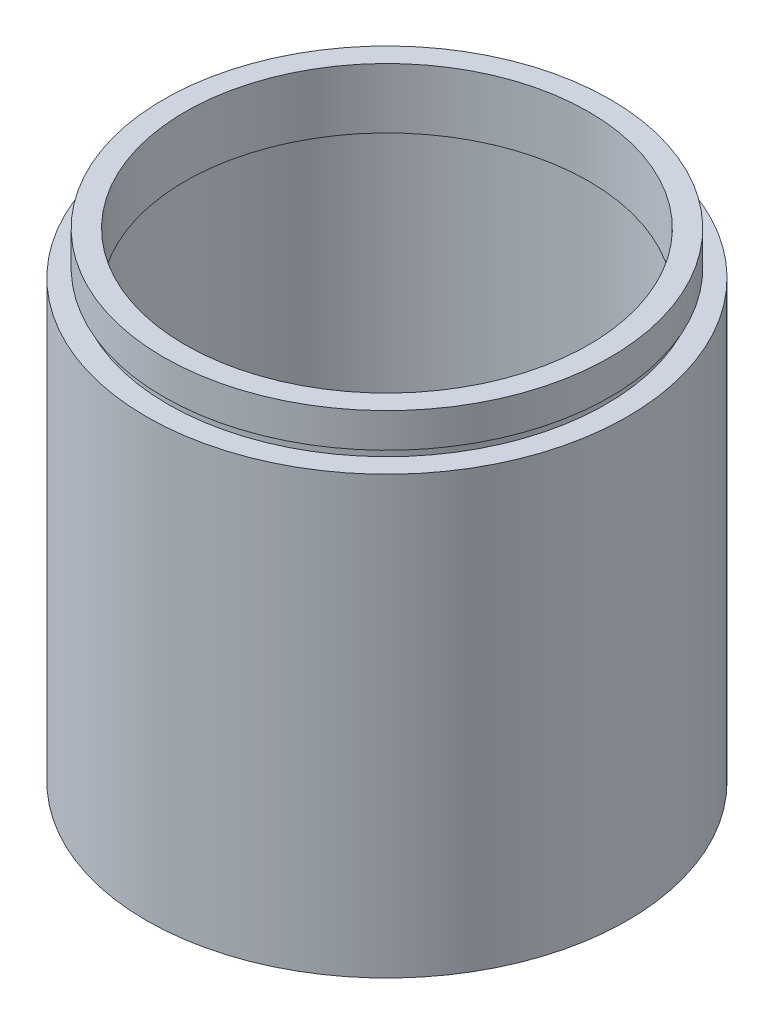
ISO-10303-21;
HEADER;
FILE_DESCRIPTION(('STEP AP214'),'2;1');
FILE_NAME('part.step','',(''),(''),'','','');
FILE_SCHEMA(('AUTOMOTIVE_DESIGN { 1 0 10303 214 1 1 1 1 }'));
ENDSEC;
DATA;
#1=APPLICATION_CONTEXT('core data for automotive mechanical design processes');
#2=APPLICATION_PROTOCOL_DEFINITION('international standard','automotive_design',2000,#1);
#3=PRODUCT_CONTEXT('',#1,'mechanical');
#4=PRODUCT('Part','Part','',(#3));
#5=PRODUCT_RELATED_PRODUCT_CATEGORY('part','',(#4));
#6=PRODUCT_DEFINITION_FORMATION('','',#4);
#7=PRODUCT_DEFINITION_CONTEXT('part definition',#1,'design');
#8=PRODUCT_DEFINITION('design','',#6,#7);
#9=PRODUCT_DEFINITION_SHAPE('','',#8);
#10=(LENGTH_UNIT() NAMED_UNIT(*) SI_UNIT(.MILLI.,.METRE.));
#11=(NAMED_UNIT(*) PLANE_ANGLE_UNIT() SI_UNIT($,.RADIAN.));
#12=(NAMED_UNIT(*) SI_UNIT($,.STERADIAN.) SOLID_ANGLE_UNIT());
#13=UNCERTAINTY_MEASURE_WITH_UNIT(LENGTH_MEASURE(1.E-05),#10,'distance_accuracy_value','');
#14=(GEOMETRIC_REPRESENTATION_CONTEXT(3) GLOBAL_UNCERTAINTY_ASSIGNED_CONTEXT((#13)) GLOBAL_UNIT_ASSIGNED_CONTEXT((#10,
#11,#12)) REPRESENTATION_CONTEXT('',''));
#15=CARTESIAN_POINT('',(0.,0.,0.));
#16=DIRECTION('',(0.,0.,1.));
#17=DIRECTION('',(1.,0.,0.));
#18=AXIS2_PLACEMENT_3D('',#15,#16,#17);
#19=CARTESIAN_POINT('',(0.,161.376166943427,0.));
#20=DIRECTION('',(0.,1.,0.));
#21=DIRECTION('',(0.,0.,1.));
#22=AXIS2_PLACEMENT_3D('',#19,#20,#21);
#23=CYLINDRICAL_SURFACE('',#22,23.5);
#24=CARTESIAN_POINT('',(0.,48.8,0.));
#25=DIRECTION('',(0.,1.,0.));
#26=DIRECTION('',(0.,0.,1.));
#27=AXIS2_PLACEMENT_3D('',#24,#25,#26);
#28=CIRCLE('',#27,23.5);
#29=CARTESIAN_POINT('',(0.,48.8,23.5));
#30=VERTEX_POINT('',#29);
#31=EDGE_CURVE('E77',#30,#30,#28,.T.);
#32=ORIENTED_EDGE('',*,*,#31,.F.);
#33=EDGE_LOOP('',(#32));
#34=FACE_BOUND('',#33,.T.);
#35=CARTESIAN_POINT('',(0.,55.8,0.));
#36=DIRECTION('',(0.,1.,0.));
#37=DIRECTION('',(0.,0.,1.));
#38=AXIS2_PLACEMENT_3D('',#35,#36,#37);
#39=CIRCLE('',#38,23.5);
#40=CARTESIAN_POINT('',(0.,55.8,23.5));
#41=VERTEX_POINT('',#40);
#42=EDGE_CURVE('E10',#41,#41,#39,.T.);
#43=ORIENTED_EDGE('',*,*,#42,.T.);
#44=EDGE_LOOP('',(#43));
#45=FACE_BOUND('',#44,.T.);
#46=ADVANCED_FACE('F37',(#34,#45),#23,.F.);
#47=CARTESIAN_POINT('',(23.5,55.8,0.));
#48=DIRECTION('',(0.,-1.,0.));
#49=DIRECTION('',(0.,0.,-1.));
#50=AXIS2_PLACEMENT_3D('',#47,#48,#49);
#51=PLANE('',#50);
#52=ORIENTED_EDGE('',*,*,#42,.F.);
#53=EDGE_LOOP('',(#52));
#54=FACE_BOUND('',#53,.T.);
#55=CARTESIAN_POINT('',(0.,55.8,0.));
#56=DIRECTION('',(0.,1.,0.));
#57=DIRECTION('',(0.,0.,1.));
#58=AXIS2_PLACEMENT_3D('',#55,#56,#57);
#59=CIRCLE('',#58,26.);
#60=CARTESIAN_POINT('',(0.,55.8,26.));
#61=VERTEX_POINT('',#60);
#62=EDGE_CURVE('E43',#61,#61,#59,.T.);
#63=ORIENTED_EDGE('',*,*,#62,.T.);
#64=EDGE_LOOP('',(#63));
#65=FACE_BOUND('',#64,.T.);
#66=ADVANCED_FACE('F84',(#54,#65),#51,.F.);
#67=CARTESIAN_POINT('',(0.,161.376166943427,0.));
#68=DIRECTION('',(0.,1.,0.));
#69=DIRECTION('',(0.,0.,1.));
#70=AXIS2_PLACEMENT_3D('',#67,#68,#69);
#71=CYLINDRICAL_SURFACE('',#70,26.);
#72=ORIENTED_EDGE('',*,*,#62,.F.);
#73=EDGE_LOOP('',(#72));
#74=FACE_BOUND('',#73,.T.);
#75=CARTESIAN_POINT('',(0.,51.8,0.));
#76=DIRECTION('',(0.,1.,0.));
#77=DIRECTION('',(0.,0.,1.));
#78=AXIS2_PLACEMENT_3D('',#75,#76,#77);
#79=CIRCLE('',#78,26.);
#80=CARTESIAN_POINT('',(0.,51.8,26.));
#81=VERTEX_POINT('',#80);
#82=EDGE_CURVE('E47',#81,#81,#79,.T.);
#83=ORIENTED_EDGE('',*,*,#82,.T.);
#84=EDGE_LOOP('',(#83));
#85=FACE_BOUND('',#84,.T.);
#86=ADVANCED_FACE('F88',(#74,#85),#71,.T.);
#87=CARTESIAN_POINT('',(26.,51.8,0.));
#88=DIRECTION('',(0.,1.,0.));
#89=DIRECTION('',(0.,0.,1.));
#90=AXIS2_PLACEMENT_3D('',#87,#88,#89);
#91=PLANE('',#90);
#92=ORIENTED_EDGE('',*,*,#82,.F.);
#93=EDGE_LOOP('',(#92));
#94=FACE_BOUND('',#93,.T.);
#95=CARTESIAN_POINT('',(0.,51.8,0.));
#96=DIRECTION('',(0.,1.,0.));
#97=DIRECTION('',(0.,0.,1.));
#98=AXIS2_PLACEMENT_3D('',#95,#96,#97);
#99=CIRCLE('',#98,25.5);
#100=CARTESIAN_POINT('',(0.,51.8,25.5));
#101=VERTEX_POINT('',#100);
#102=EDGE_CURVE('E51',#101,#101,#99,.T.);
#103=ORIENTED_EDGE('',*,*,#102,.T.);
#104=EDGE_LOOP('',(#103));
#105=FACE_BOUND('',#104,.T.);
#106=ADVANCED_FACE('F93',(#94,#105),#91,.F.);
#107=CARTESIAN_POINT('',(0.,161.376166943427,0.));
#108=DIRECTION('',(0.,1.,0.));
#109=DIRECTION('',(0.,0.,1.));
#110=AXIS2_PLACEMENT_3D('',#107,#108,#109);
#111=CYLINDRICAL_SURFACE('',#110,25.5);
#112=ORIENTED_EDGE('',*,*,#102,.F.);
#113=EDGE_LOOP('',(#112));
#114=FACE_BOUND('',#113,.T.);
#115=CARTESIAN_POINT('',(0.,50.8,0.));
#116=DIRECTION('',(0.,1.,0.));
#117=DIRECTION('',(0.,0.,1.));
#118=AXIS2_PLACEMENT_3D('',#115,#116,#117);
#119=CIRCLE('',#118,25.5);
#120=CARTESIAN_POINT('',(0.,50.8,25.5));
#121=VERTEX_POINT('',#120);
#122=EDGE_CURVE('E56',#121,#121,#119,.T.);
#123=ORIENTED_EDGE('',*,*,#122,.T.);
#124=EDGE_LOOP('',(#123));
#125=FACE_BOUND('',#124,.T.);
#126=ADVANCED_FACE('F99',(#114,#125),#111,.T.);
#127=CARTESIAN_POINT('',(25.5,50.8,0.));
#128=DIRECTION('',(0.,-1.,0.));
#129=DIRECTION('',(0.,0.,-1.));
#130=AXIS2_PLACEMENT_3D('',#127,#128,#129);
#131=PLANE('',#130);
#132=ORIENTED_EDGE('',*,*,#122,.F.);
#133=EDGE_LOOP('',(#132));
#134=FACE_BOUND('',#133,.T.);
#135=CARTESIAN_POINT('',(0.,50.8,0.));
#136=DIRECTION('',(0.,1.,0.));
#137=DIRECTION('',(0.,0.,1.));
#138=AXIS2_PLACEMENT_3D('',#135,#136,#137);
#139=CIRCLE('',#138,28.);
#140=CARTESIAN_POINT('',(0.,50.8,28.));
#141=VERTEX_POINT('',#140);
#142=EDGE_CURVE('E59',#141,#141,#139,.T.);
#143=ORIENTED_EDGE('',*,*,#142,.T.);
#144=EDGE_LOOP('',(#143));
#145=FACE_BOUND('',#144,.T.);
#146=ADVANCED_FACE('F103',(#134,#145),#131,.F.);
#147=CARTESIAN_POINT('',(0.,161.376166943427,0.));
#148=DIRECTION('',(0.,1.,0.));
#149=DIRECTION('',(0.,0.,1.));
#150=AXIS2_PLACEMENT_3D('',#147,#148,#149);
#151=CYLINDRICAL_SURFACE('',#150,28.);
#152=ORIENTED_EDGE('',*,*,#142,.F.);
#153=EDGE_LOOP('',(#152));
#154=FACE_BOUND('',#153,.T.);
#155=CARTESIAN_POINT('',(0.,0.,0.));
#156=DIRECTION('',(0.,1.,0.));
#157=DIRECTION('',(0.,0.,1.));
#158=AXIS2_PLACEMENT_3D('',#155,#156,#157);
#159=CIRCLE('',#158,28.);
#160=CARTESIAN_POINT('',(0.,0.,28.));
#161=VERTEX_POINT('',#160);
#162=EDGE_CURVE('E62',#161,#161,#159,.T.);
#163=ORIENTED_EDGE('',*,*,#162,.T.);
#164=EDGE_LOOP('',(#163));
#165=FACE_BOUND('',#164,.T.);
#166=ADVANCED_FACE('F107',(#154,#165),#151,.T.);
#167=CARTESIAN_POINT('',(28.,0.,0.));
#168=DIRECTION('',(0.,1.,0.));
#169=DIRECTION('',(0.,0.,1.));
#170=AXIS2_PLACEMENT_3D('',#167,#168,#169);
#171=PLANE('',#170);
#172=ORIENTED_EDGE('',*,*,#162,.F.);
#173=EDGE_LOOP('',(#172));
#174=FACE_BOUND('',#173,.T.);
#175=CARTESIAN_POINT('',(0.,0.,0.));
#176=DIRECTION('',(0.,1.,0.));
#177=DIRECTION('',(0.,0.,1.));
#178=AXIS2_PLACEMENT_3D('',#175,#176,#177);
#179=CIRCLE('',#178,25.5);
#180=CARTESIAN_POINT('',(0.,0.,25.5));
#181=VERTEX_POINT('',#180);
#182=EDGE_CURVE('E65',#181,#181,#179,.T.);
#183=ORIENTED_EDGE('',*,*,#182,.T.);
#184=EDGE_LOOP('',(#183));
#185=FACE_BOUND('',#184,.T.);
#186=ADVANCED_FACE('F111',(#174,#185),#171,.F.);
#187=CARTESIAN_POINT('',(0.,161.376166943427,0.));
#188=DIRECTION('',(0.,1.,0.));
#189=DIRECTION('',(0.,0.,1.));
#190=AXIS2_PLACEMENT_3D('',#187,#188,#189);
#191=CYLINDRICAL_SURFACE('',#190,25.5);
#192=ORIENTED_EDGE('',*,*,#182,.F.);
#193=EDGE_LOOP('',(#192));
#194=FACE_BOUND('',#193,.T.);
#195=CARTESIAN_POINT('',(0.,47.8,0.));
#196=DIRECTION('',(0.,1.,0.));
#197=DIRECTION('',(0.,0.,1.));
#198=AXIS2_PLACEMENT_3D('',#195,#196,#197);
#199=CIRCLE('',#198,25.5);
#200=CARTESIAN_POINT('',(0.,47.8,25.5));
#201=VERTEX_POINT('',#200);
#202=EDGE_CURVE('E68',#201,#201,#199,.T.);
#203=ORIENTED_EDGE('',*,*,#202,.T.);
#204=EDGE_LOOP('',(#203));
#205=FACE_BOUND('',#204,.T.);
#206=ADVANCED_FACE('F115',(#194,#205),#191,.F.);
#207=CARTESIAN_POINT('',(25.5,47.8,0.));
#208=DIRECTION('',(0.,-1.,0.));
#209=DIRECTION('',(0.,0.,-1.));
#210=AXIS2_PLACEMENT_3D('',#207,#208,#209);
#211=PLANE('',#210);
#212=ORIENTED_EDGE('',*,*,#202,.F.);
#213=EDGE_LOOP('',(#212));
#214=FACE_BOUND('',#213,.T.);
#215=CARTESIAN_POINT('',(0.,47.8,0.));
#216=DIRECTION('',(0.,1.,0.));
#217=DIRECTION('',(0.,0.,1.));
#218=AXIS2_PLACEMENT_3D('',#215,#216,#217);
#219=CIRCLE('',#218,26.1);
#220=CARTESIAN_POINT('',(0.,47.8,26.1));
#221=VERTEX_POINT('',#220);
#222=EDGE_CURVE('E71',#221,#221,#219,.T.);
#223=ORIENTED_EDGE('',*,*,#222,.T.);
#224=EDGE_LOOP('',(#223));
#225=FACE_BOUND('',#224,.T.);
#226=ADVANCED_FACE('F119',(#214,#225),#211,.F.);
#227=CARTESIAN_POINT('',(0.,161.376166943427,0.));
#228=DIRECTION('',(0.,1.,0.));
#229=DIRECTION('',(0.,0.,1.));
#230=AXIS2_PLACEMENT_3D('',#227,#228,#229);
#231=CYLINDRICAL_SURFACE('',#230,26.1);
#232=ORIENTED_EDGE('',*,*,#222,.F.);
#233=EDGE_LOOP('',(#232));
#234=FACE_BOUND('',#233,.T.);
#235=CARTESIAN_POINT('',(0.,48.8,0.));
#236=DIRECTION('',(0.,1.,0.));
#237=DIRECTION('',(0.,0.,1.));
#238=AXIS2_PLACEMENT_3D('',#235,#236,#237);
#239=CIRCLE('',#238,26.1);
#240=CARTESIAN_POINT('',(0.,48.8,26.1));
#241=VERTEX_POINT('',#240);
#242=EDGE_CURVE('E74',#241,#241,#239,.T.);
#243=ORIENTED_EDGE('',*,*,#242,.T.);
#244=EDGE_LOOP('',(#243));
#245=FACE_BOUND('',#244,.T.);
#246=ADVANCED_FACE('F123',(#234,#245),#231,.F.);
#247=CARTESIAN_POINT('',(26.1,48.8,0.));
#248=DIRECTION('',(0.,1.,0.));
#249=DIRECTION('',(0.,0.,1.));
#250=AXIS2_PLACEMENT_3D('',#247,#248,#249);
#251=PLANE('',#250);
#252=ORIENTED_EDGE('',*,*,#242,.F.);
#253=EDGE_LOOP('',(#252));
#254=FACE_BOUND('',#253,.T.);
#255=ORIENTED_EDGE('',*,*,#31,.T.);
#256=EDGE_LOOP('',(#255));
#257=FACE_BOUND('',#256,.T.);
#258=ADVANCED_FACE('F81',(#254,#257),#251,.F.);
#259=CLOSED_SHELL('',(#46,#66,#86,#106,#126,#146,#166,#186,#206,#226,#246,#258));
#260=MANIFOLD_SOLID_BREP('B2',#259);
#261=ADVANCED_BREP_SHAPE_REPRESENTATION('',(#18,#260),#14);
#262=SHAPE_DEFINITION_REPRESENTATION(#9,#261);
ENDSEC;
END-ISO-10303-21;
